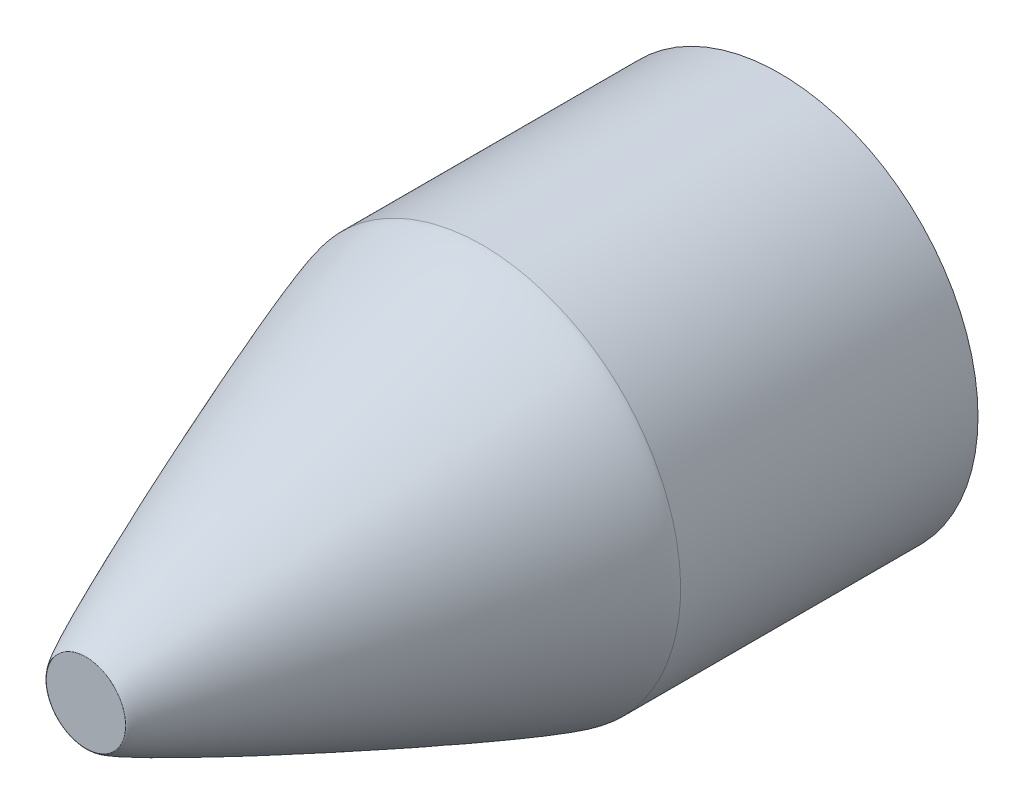
ISO-10303-21;
HEADER;
FILE_DESCRIPTION(('STEP AP214'),'2;1');
FILE_NAME('part.step','',(''),(''),'','','');
FILE_SCHEMA(('AUTOMOTIVE_DESIGN { 1 0 10303 214 1 1 1 1 }'));
ENDSEC;
DATA;
#1=APPLICATION_CONTEXT('core data for automotive mechanical design processes');
#2=APPLICATION_PROTOCOL_DEFINITION('international standard','automotive_design',2000,#1);
#3=PRODUCT_CONTEXT('',#1,'mechanical');
#4=PRODUCT('Part','Part','',(#3));
#5=PRODUCT_RELATED_PRODUCT_CATEGORY('part','',(#4));
#6=PRODUCT_DEFINITION_FORMATION('','',#4);
#7=PRODUCT_DEFINITION_CONTEXT('part definition',#1,'design');
#8=PRODUCT_DEFINITION('design','',#6,#7);
#9=PRODUCT_DEFINITION_SHAPE('','',#8);
#10=(LENGTH_UNIT() NAMED_UNIT(*) SI_UNIT(.MILLI.,.METRE.));
#11=(NAMED_UNIT(*) PLANE_ANGLE_UNIT() SI_UNIT($,.RADIAN.));
#12=(NAMED_UNIT(*) SI_UNIT($,.STERADIAN.) SOLID_ANGLE_UNIT());
#13=UNCERTAINTY_MEASURE_WITH_UNIT(LENGTH_MEASURE(1.E-05),#10,'distance_accuracy_value','');
#14=(GEOMETRIC_REPRESENTATION_CONTEXT(3) GLOBAL_UNCERTAINTY_ASSIGNED_CONTEXT((#13)) GLOBAL_UNIT_ASSIGNED_CONTEXT((#10,
#11,#12)) REPRESENTATION_CONTEXT('',''));
#15=CARTESIAN_POINT('',(0.,0.,0.));
#16=DIRECTION('',(0.,0.,1.));
#17=DIRECTION('',(1.,0.,0.));
#18=AXIS2_PLACEMENT_3D('',#15,#16,#17);
#19=CARTESIAN_POINT('',(-2.,0.,35.));
#20=CARTESIAN_POINT('',(-2.,-0.523598753781683,35.));
#21=CARTESIAN_POINT('',(-1.78445379179298,-1.04397333295321,35.));
#22=CARTESIAN_POINT('',(-1.0439733329532,-1.78445379179299,35.));
#23=CARTESIAN_POINT('',(-0.523598753781449,-2.,35.));
#24=CARTESIAN_POINT('',(0.523598753781452,-2.,35.));
#25=CARTESIAN_POINT('',(1.04397333295304,-1.78445379179315,35.));
#26=CARTESIAN_POINT('',(1.78445379179315,-1.04397333295304,35.));
#27=CARTESIAN_POINT('',(2.,-0.523598753781667,35.));
#28=CARTESIAN_POINT('',(2.,0.523598753781667,35.));
#29=CARTESIAN_POINT('',(1.78445379179298,1.04397333295321,35.));
#30=CARTESIAN_POINT('',(1.04397333295321,1.78445379179298,35.));
#31=CARTESIAN_POINT('',(0.523598753781684,2.,35.));
#32=CARTESIAN_POINT('',(-0.523598753781683,2.,35.));
#33=CARTESIAN_POINT('',(-1.04397333295326,1.78445379179293,35.));
#34=CARTESIAN_POINT('',(-1.78445379179293,1.04397333295326,35.));
#35=CARTESIAN_POINT('',(-2.,0.523598753781684,35.));
#36=CARTESIAN_POINT('',(-2.,0.,35.));
#37=CARTESIAN_POINT('',(-10.,0.,35.));
#38=CARTESIAN_POINT('',(-10.,-2.61799376890842,35.));
#39=CARTESIAN_POINT('',(-8.92226895896498,-5.21986666476575,35.));
#40=CARTESIAN_POINT('',(-5.21986666476597,-8.92226895896522,35.));
#41=CARTESIAN_POINT('',(-2.61799376890725,-10.,35.));
#42=CARTESIAN_POINT('',(2.61799376890726,-10.,35.));
#43=CARTESIAN_POINT('',(5.21986666476493,-8.92226895896535,35.));
#44=CARTESIAN_POINT('',(8.92226895896604,-5.2198666647656,35.));
#45=CARTESIAN_POINT('',(10.0000000000005,-2.61799376890833,35.0000000000036));
#46=CARTESIAN_POINT('',(9.99999999999955,2.61799376890833,34.9999999999964));
#47=CARTESIAN_POINT('',(8.9222689589649,5.21986666476606,35.));
#48=CARTESIAN_POINT('',(5.21986666476606,8.9222689589649,35.));
#49=CARTESIAN_POINT('',(2.61799376890842,10.,35.));
#50=CARTESIAN_POINT('',(-2.61799376890842,10.,35.));
#51=CARTESIAN_POINT('',(-5.2198666647662,8.92226895896453,35.));
#52=CARTESIAN_POINT('',(-8.92226895896476,5.21986666476642,35.));
#53=CARTESIAN_POINT('',(-10.,2.61799376890842,35.));
#54=CARTESIAN_POINT('',(-10.,0.,35.));
#55=CARTESIAN_POINT('',(-10.,0.,15.));
#56=CARTESIAN_POINT('',(-10.,-2.61799376890842,15.));
#57=CARTESIAN_POINT('',(-8.92226895896498,-5.21986666476598,15.));
#58=CARTESIAN_POINT('',(-5.21986666476597,-8.92226895896498,15.));
#59=CARTESIAN_POINT('',(-2.61799376890725,-10.,15.));
#60=CARTESIAN_POINT('',(2.61799376890726,-10.,15.));
#61=CARTESIAN_POINT('',(5.21986666476527,-8.92226895896569,15.));
#62=CARTESIAN_POINT('',(8.92226895896569,-5.21986666476526,15.));
#63=CARTESIAN_POINT('',(10.,-2.61799376890833,15.));
#64=CARTESIAN_POINT('',(10.,2.61799376890833,15.));
#65=CARTESIAN_POINT('',(8.9222689589649,5.21986666476606,15.));
#66=CARTESIAN_POINT('',(5.21986666476606,8.92226895896489,15.));
#67=CARTESIAN_POINT('',(2.61799376890842,10.,15.));
#68=CARTESIAN_POINT('',(-2.61799376890842,10.,15.));
#69=CARTESIAN_POINT('',(-5.21986666476632,8.92226895896464,15.));
#70=CARTESIAN_POINT('',(-8.92226895896465,5.21986666476631,15.));
#71=CARTESIAN_POINT('',(-10.,2.61799376890842,15.));
#72=CARTESIAN_POINT('',(-10.,0.,15.));
#73=(BOUNDED_SURFACE() B_SPLINE_SURFACE(2,3,((#19,#20,#21,#22,#23,#24,#25,#26,#27,#28,#29,#30,
#31,#32,#33,#34,#35,#36),(#37,#38,#39,#40,#41,#42,#43,#44,#45,#46,#47,#48,#49,#50,#51,#52,#53,
#54),(#55,#56,#57,#58,#59,#60,#61,#62,#63,#64,#65,#66,#67,#68,#69,#70,#71,#72)),.UNSPECIFIED.,
.F.,.T.,.F.) B_SPLINE_SURFACE_WITH_KNOTS((3,3),(4,2,2,2,2,2,2,2,4),(0.,1.),(-3.14159265358979,
-2.35619449019234,-1.5707963267949,-0.785398163397448,0.,0.785398163397448,1.5707963267949,
2.35619449019234,3.14159265358979),
.UNSPECIFIED.) GEOMETRIC_REPRESENTATION_ITEM() RATIONAL_B_SPLINE_SURFACE(((1.,1.,1.,1.,1.,1.,1.,
1.,1.,1.,1.,1.,1.,1.,1.,1.,1.,1.),(0.0526315789473684,0.0526315789473684,0.0526315789473684,
0.0526315789473684,0.0526315789473684,0.0526315789473684,0.0526315789473684,0.0526315789473684,
0.0526315789473684,0.0526315789473684,0.0526315789473684,0.0526315789473684,0.0526315789473684,
0.0526315789473684,0.0526315789473684,0.0526315789473684,0.0526315789473684,0.0526315789473684),
(1.,1.,1.,1.,1.,1.,1.,1.,1.,1.,1.,1.,1.,1.,1.,1.,1.,1.))) REPRESENTATION_ITEM('') SURFACE());
#74=CARTESIAN_POINT('',(-2.,0.,35.));
#75=CARTESIAN_POINT('',(-2.,0.523598753781684,35.));
#76=CARTESIAN_POINT('',(-1.78445379179293,1.04397333295326,35.));
#77=CARTESIAN_POINT('',(-1.04397333295326,1.78445379179293,35.));
#78=CARTESIAN_POINT('',(-0.523598753781683,2.,35.));
#79=CARTESIAN_POINT('',(0.523598753781684,2.,35.));
#80=CARTESIAN_POINT('',(1.04397333295321,1.78445379179298,35.));
#81=CARTESIAN_POINT('',(1.78445379179298,1.04397333295321,35.));
#82=CARTESIAN_POINT('',(2.,0.523598753781667,35.));
#83=CARTESIAN_POINT('',(2.,-0.523598753781667,35.));
#84=CARTESIAN_POINT('',(1.78445379179315,-1.04397333295304,35.));
#85=CARTESIAN_POINT('',(1.04397333295304,-1.78445379179315,35.));
#86=CARTESIAN_POINT('',(0.523598753781452,-2.,35.));
#87=CARTESIAN_POINT('',(-0.523598753781449,-2.,35.));
#88=CARTESIAN_POINT('',(-1.0439733329532,-1.78445379179299,35.));
#89=CARTESIAN_POINT('',(-1.78445379179298,-1.04397333295321,35.));
#90=CARTESIAN_POINT('',(-2.,-0.523598753781683,35.));
#91=CARTESIAN_POINT('',(-2.,0.,35.));
#92=(BOUNDED_CURVE() B_SPLINE_CURVE(3,(#74,#75,#76,#77,#78,#79,#80,#81,#82,#83,#84,#85,#86,#87,
#88,#89,#90,#91),.UNSPECIFIED.,.T.,.F.) B_SPLINE_CURVE_WITH_KNOTS((4,2,2,2,2,2,2,2,4),
(-3.14159265358979,-2.35619449019234,-1.5707963267949,-0.785398163397448,0.,0.785398163397448,
1.5707963267949,2.35619449019234,3.14159265358979),
.UNSPECIFIED.) CURVE() GEOMETRIC_REPRESENTATION_ITEM() RATIONAL_B_SPLINE_CURVE((1.,1.,1.,1.,1.,
1.,1.,1.,1.,1.,1.,1.,1.,1.,1.,1.,1.,1.)) REPRESENTATION_ITEM(''));
#93=CARTESIAN_POINT('',(-2.,0.,35.));
#94=VERTEX_POINT('',#93);
#95=EDGE_CURVE('E470',#94,#94,#92,.F.);
#96=CARTESIAN_POINT('',(-10.,0.,15.));
#97=CARTESIAN_POINT('',(-10.,-2.61799376890842,15.));
#98=CARTESIAN_POINT('',(-8.92226895896498,-5.21986666476598,15.));
#99=CARTESIAN_POINT('',(-5.21986666476597,-8.92226895896498,15.));
#100=CARTESIAN_POINT('',(-2.61799376890725,-10.,15.));
#101=CARTESIAN_POINT('',(2.61799376890726,-10.,15.));
#102=CARTESIAN_POINT('',(5.21986666476527,-8.92226895896569,15.));
#103=CARTESIAN_POINT('',(8.92226895896569,-5.21986666476526,15.));
#104=CARTESIAN_POINT('',(10.,-2.61799376890833,15.));
#105=CARTESIAN_POINT('',(10.,2.61799376890833,15.));
#106=CARTESIAN_POINT('',(8.9222689589649,5.21986666476606,15.));
#107=CARTESIAN_POINT('',(5.21986666476606,8.92226895896489,15.));
#108=CARTESIAN_POINT('',(2.61799376890842,10.,15.));
#109=CARTESIAN_POINT('',(-2.61799376890842,10.,15.));
#110=CARTESIAN_POINT('',(-5.21986666476632,8.92226895896464,15.));
#111=CARTESIAN_POINT('',(-8.92226895896465,5.21986666476631,15.));
#112=CARTESIAN_POINT('',(-10.,2.61799376890842,15.));
#113=CARTESIAN_POINT('',(-10.,0.,15.));
#114=(BOUNDED_CURVE() B_SPLINE_CURVE(3,(#96,#97,#98,#99,#100,#101,#102,#103,#104,#105,#106,#107,
#108,#109,#110,#111,#112,#113),.UNSPECIFIED.,.T.,.F.) B_SPLINE_CURVE_WITH_KNOTS((4,2,2,2,2,2,2,
2,4),(-3.14159265358979,-2.35619449019234,-1.5707963267949,-0.785398163397448,0.,
0.785398163397448,1.5707963267949,2.35619449019234,3.14159265358979),
.UNSPECIFIED.) CURVE() GEOMETRIC_REPRESENTATION_ITEM() RATIONAL_B_SPLINE_CURVE((1.,1.,1.,1.,1.,
1.,1.,1.,1.,1.,1.,1.,1.,1.,1.,1.,1.,1.)) REPRESENTATION_ITEM(''));
#115=CARTESIAN_POINT('',(-10.,0.,15.));
#116=VERTEX_POINT('',#115);
#117=EDGE_CURVE('E474',#116,#116,#114,.F.);
#118=ORIENTED_EDGE('',*,*,#95,.F.);
#119=EDGE_LOOP('',(#118));
#120=FACE_BOUND('',#119,.T.);
#121=ORIENTED_EDGE('',*,*,#117,.F.);
#122=EDGE_LOOP('',(#121));
#123=FACE_BOUND('',#122,.T.);
#124=ADVANCED_FACE('F38',(#120,#123),#73,.T.);
#125=CARTESIAN_POINT('',(0.,0.,35.));
#126=DIRECTION('',(0.,0.,-1.));
#127=DIRECTION('',(-1.,0.,0.));
#128=AXIS2_PLACEMENT_3D('',#125,#126,#127);
#129=CYLINDRICAL_SURFACE('',#128,10.);
#130=ORIENTED_EDGE('',*,*,#117,.T.);
#131=EDGE_LOOP('',(#130));
#132=FACE_BOUND('',#131,.T.);
#133=CARTESIAN_POINT('',(0.,0.,0.));
#134=DIRECTION('',(0.,0.,1.));
#135=DIRECTION('',(1.,0.,0.));
#136=AXIS2_PLACEMENT_3D('',#133,#134,#135);
#137=CIRCLE('',#136,10.);
#138=CARTESIAN_POINT('',(10.,0.,0.));
#139=VERTEX_POINT('',#138);
#140=EDGE_CURVE('E342',#139,#139,#137,.T.);
#141=ORIENTED_EDGE('',*,*,#140,.T.);
#142=EDGE_LOOP('',(#141));
#143=FACE_BOUND('',#142,.T.);
#144=ADVANCED_FACE('F460',(#132,#143),#129,.T.);
#145=CARTESIAN_POINT('',(0.,0.,35.));
#146=DIRECTION('',(0.,0.,1.));
#147=DIRECTION('',(1.,0.,0.));
#148=AXIS2_PLACEMENT_3D('',#145,#146,#147);
#149=PLANE('',#148);
#150=ORIENTED_EDGE('',*,*,#95,.T.);
#151=EDGE_LOOP('',(#150));
#152=FACE_BOUND('',#151,.T.);
#153=ADVANCED_FACE('F465',(#152),#149,.T.);
#154=CARTESIAN_POINT('',(0.,0.,0.));
#155=DIRECTION('',(0.,0.,1.));
#156=DIRECTION('',(1.,0.,0.));
#157=AXIS2_PLACEMENT_3D('',#154,#155,#156);
#158=PLANE('',#157);
#159=DIRECTION('',(1.,0.,0.));
#160=VECTOR('',#159,1.);
#161=CARTESIAN_POINT('',(6.5,5.5,0.));
#162=LINE('',#161,#160);
#163=CARTESIAN_POINT('',(-1.49999999999999,5.5,0.));
#164=VERTEX_POINT('',#163);
#165=CARTESIAN_POINT('',(1.5,5.5,0.));
#166=VERTEX_POINT('',#165);
#167=EDGE_CURVE('E350',#164,#166,#162,.T.);
#168=ORIENTED_EDGE('',*,*,#167,.F.);
#169=CARTESIAN_POINT('',(-6.5,0.5,0.));
#170=CARTESIAN_POINT('',(-6.5,5.5,0.));
#171=CARTESIAN_POINT('',(-1.5,5.5,0.));
#172=(BOUNDED_CURVE() B_SPLINE_CURVE(2,(#169,#170,#171),.UNSPECIFIED.,.F.,
.F.) B_SPLINE_CURVE_WITH_KNOTS((3,3),(0.,1.),
.UNSPECIFIED.) CURVE() GEOMETRIC_REPRESENTATION_ITEM() RATIONAL_B_SPLINE_CURVE((1.,0.25,1.)) REPRESENTATION_ITEM(''));
#173=CARTESIAN_POINT('',(-6.5,0.5,0.));
#174=VERTEX_POINT('',#173);
#175=EDGE_CURVE('E12',#164,#174,#172,.F.);
#176=ORIENTED_EDGE('',*,*,#175,.T.);
#177=DIRECTION('',(0.,1.,0.));
#178=VECTOR('',#177,1.);
#179=CARTESIAN_POINT('',(-6.5,-5.5,0.));
#180=LINE('',#179,#178);
#181=CARTESIAN_POINT('',(-6.5,-0.499999999999999,0.));
#182=VERTEX_POINT('',#181);
#183=EDGE_CURVE('E357',#182,#174,#180,.T.);
#184=ORIENTED_EDGE('',*,*,#183,.F.);
#185=CARTESIAN_POINT('',(-1.5,-5.5,0.));
#186=CARTESIAN_POINT('',(-6.5,-5.5,0.));
#187=CARTESIAN_POINT('',(-6.5,-0.499999999999999,0.));
#188=(BOUNDED_CURVE() B_SPLINE_CURVE(2,(#185,#186,#187),.UNSPECIFIED.,.F.,
.F.) B_SPLINE_CURVE_WITH_KNOTS((3,3),(0.,1.),
.UNSPECIFIED.) CURVE() GEOMETRIC_REPRESENTATION_ITEM() RATIONAL_B_SPLINE_CURVE((1.,0.25,1.)) REPRESENTATION_ITEM(''));
#189=CARTESIAN_POINT('',(-1.49999999999999,-5.5,0.));
#190=VERTEX_POINT('',#189);
#191=EDGE_CURVE('E52',#182,#190,#188,.F.);
#192=ORIENTED_EDGE('',*,*,#191,.T.);
#193=DIRECTION('',(-1.,0.,0.));
#194=VECTOR('',#193,1.);
#195=CARTESIAN_POINT('',(6.5,-5.5,0.));
#196=LINE('',#195,#194);
#197=CARTESIAN_POINT('',(1.5,-5.5,0.));
#198=VERTEX_POINT('',#197);
#199=EDGE_CURVE('E336',#198,#190,#196,.T.);
#200=ORIENTED_EDGE('',*,*,#199,.F.);
#201=CARTESIAN_POINT('',(6.5,-0.499999999999999,0.));
#202=CARTESIAN_POINT('',(6.5,-5.5,0.));
#203=CARTESIAN_POINT('',(1.5,-5.5,0.));
#204=(BOUNDED_CURVE() B_SPLINE_CURVE(2,(#201,#202,#203),.UNSPECIFIED.,.F.,
.F.) B_SPLINE_CURVE_WITH_KNOTS((3,3),(0.,1.),
.UNSPECIFIED.) CURVE() GEOMETRIC_REPRESENTATION_ITEM() RATIONAL_B_SPLINE_CURVE((1.,0.25,1.)) REPRESENTATION_ITEM(''));
#205=CARTESIAN_POINT('',(6.5,-0.499999999999999,0.));
#206=VERTEX_POINT('',#205);
#207=EDGE_CURVE('E205',#198,#206,#204,.F.);
#208=ORIENTED_EDGE('',*,*,#207,.T.);
#209=DIRECTION('',(0.,-1.,0.));
#210=VECTOR('',#209,1.);
#211=CARTESIAN_POINT('',(6.5,-5.5,0.));
#212=LINE('',#211,#210);
#213=CARTESIAN_POINT('',(6.5,0.5,0.));
#214=VERTEX_POINT('',#213);
#215=EDGE_CURVE('E356',#214,#206,#212,.T.);
#216=ORIENTED_EDGE('',*,*,#215,.F.);
#217=CARTESIAN_POINT('',(1.5,5.5,0.));
#218=CARTESIAN_POINT('',(6.5,5.5,0.));
#219=CARTESIAN_POINT('',(6.5,0.5,0.));
#220=(BOUNDED_CURVE() B_SPLINE_CURVE(2,(#217,#218,#219),.UNSPECIFIED.,.F.,
.F.) B_SPLINE_CURVE_WITH_KNOTS((3,3),(0.,1.),
.UNSPECIFIED.) CURVE() GEOMETRIC_REPRESENTATION_ITEM() RATIONAL_B_SPLINE_CURVE((1.,0.25,1.)) REPRESENTATION_ITEM(''));
#221=EDGE_CURVE('E141',#214,#166,#220,.F.);
#222=ORIENTED_EDGE('',*,*,#221,.T.);
#223=EDGE_LOOP('',(#168,#176,#184,#192,#200,#208,#216,#222));
#224=FACE_BOUND('',#223,.T.);
#225=ORIENTED_EDGE('',*,*,#140,.F.);
#226=EDGE_LOOP('',(#225));
#227=FACE_BOUND('',#226,.T.);
#228=ADVANCED_FACE('F353',(#224,#227),#158,.F.);
#229=CARTESIAN_POINT('',(-6.5,-5.5,20.));
#230=DIRECTION('',(-1.,0.,0.));
#231=DIRECTION('',(0.,0.,1.));
#232=AXIS2_PLACEMENT_3D('',#229,#230,#231);
#233=PLANE('',#232);
#234=DIRECTION('',(0.,1.,0.));
#235=VECTOR('',#234,1.);
#236=CARTESIAN_POINT('',(-6.5,-5.5,20.));
#237=LINE('',#236,#235);
#238=CARTESIAN_POINT('',(-6.5,-0.499999999999999,20.));
#239=VERTEX_POINT('',#238);
#240=CARTESIAN_POINT('',(-6.5,0.5,20.));
#241=VERTEX_POINT('',#240);
#242=EDGE_CURVE('E411',#239,#241,#237,.T.);
#243=ORIENTED_EDGE('',*,*,#242,.F.);
#244=CARTESIAN_POINT('',(-6.5,-0.499999999999999,-1.));
#245=CARTESIAN_POINT('',(-6.5,-0.499999999999999,6.33333333333333));
#246=CARTESIAN_POINT('',(-6.5,-0.499999999999999,13.6666666666667));
#247=CARTESIAN_POINT('',(-6.5,-0.499999999999999,21.));
#248=(BOUNDED_CURVE() B_SPLINE_CURVE(3,(#244,#245,#246,#247),.UNSPECIFIED.,.F.,
.F.) B_SPLINE_CURVE_WITH_KNOTS((4,4),(-0.021,0.001),
.UNSPECIFIED.) CURVE() GEOMETRIC_REPRESENTATION_ITEM() RATIONAL_B_SPLINE_CURVE((1.,1.,1.,1.)) REPRESENTATION_ITEM(''));
#249=EDGE_CURVE('E327',#239,#182,#248,.F.);
#250=ORIENTED_EDGE('',*,*,#249,.T.);
#251=ORIENTED_EDGE('',*,*,#183,.T.);
#252=CARTESIAN_POINT('',(-6.5,0.5,21.));
#253=CARTESIAN_POINT('',(-6.5,0.5,13.6666666666667));
#254=CARTESIAN_POINT('',(-6.5,0.5,6.33333333333333));
#255=CARTESIAN_POINT('',(-6.5,0.5,-1.));
#256=(BOUNDED_CURVE() B_SPLINE_CURVE(3,(#252,#253,#254,#255),.UNSPECIFIED.,.F.,
.F.) B_SPLINE_CURVE_WITH_KNOTS((4,4),(-0.021,0.001),
.UNSPECIFIED.) CURVE() GEOMETRIC_REPRESENTATION_ITEM() RATIONAL_B_SPLINE_CURVE((1.,1.,1.,1.)) REPRESENTATION_ITEM(''));
#257=EDGE_CURVE('E322',#174,#241,#256,.F.);
#258=ORIENTED_EDGE('',*,*,#257,.T.);
#259=EDGE_LOOP('',(#243,#250,#251,#258));
#260=FACE_BOUND('',#259,.T.);
#261=ADVANCED_FACE('F396',(#260),#233,.F.);
#262=CARTESIAN_POINT('',(6.5,-5.5,20.));
#263=DIRECTION('',(0.,-1.,0.));
#264=DIRECTION('',(0.,0.,-1.));
#265=AXIS2_PLACEMENT_3D('',#262,#263,#264);
#266=PLANE('',#265);
#267=DIRECTION('',(-1.,0.,0.));
#268=VECTOR('',#267,1.);
#269=CARTESIAN_POINT('',(6.5,-5.5,20.));
#270=LINE('',#269,#268);
#271=CARTESIAN_POINT('',(1.5,-5.5,20.));
#272=VERTEX_POINT('',#271);
#273=CARTESIAN_POINT('',(-1.49999999999999,-5.5,20.));
#274=VERTEX_POINT('',#273);
#275=EDGE_CURVE('E137',#272,#274,#270,.T.);
#276=ORIENTED_EDGE('',*,*,#275,.F.);
#277=CARTESIAN_POINT('',(1.5,-5.5,-1.));
#278=CARTESIAN_POINT('',(1.5,-5.5,6.33333333333333));
#279=CARTESIAN_POINT('',(1.5,-5.5,13.6666666666667));
#280=CARTESIAN_POINT('',(1.5,-5.5,21.));
#281=(BOUNDED_CURVE() B_SPLINE_CURVE(3,(#277,#278,#279,#280),.UNSPECIFIED.,.F.,
.F.) B_SPLINE_CURVE_WITH_KNOTS((4,4),(-0.021,0.001),
.UNSPECIFIED.) CURVE() GEOMETRIC_REPRESENTATION_ITEM() RATIONAL_B_SPLINE_CURVE((1.,1.,1.,1.)) REPRESENTATION_ITEM(''));
#282=EDGE_CURVE('E216',#272,#198,#281,.F.);
#283=ORIENTED_EDGE('',*,*,#282,.T.);
#284=ORIENTED_EDGE('',*,*,#199,.T.);
#285=CARTESIAN_POINT('',(-1.5,-5.5,21.));
#286=CARTESIAN_POINT('',(-1.5,-5.5,13.6666666666667));
#287=CARTESIAN_POINT('',(-1.5,-5.5,6.33333333333333));
#288=CARTESIAN_POINT('',(-1.5,-5.5,-1.));
#289=(BOUNDED_CURVE() B_SPLINE_CURVE(3,(#285,#286,#287,#288),.UNSPECIFIED.,.F.,
.F.) B_SPLINE_CURVE_WITH_KNOTS((4,4),(-0.021,0.001),
.UNSPECIFIED.) CURVE() GEOMETRIC_REPRESENTATION_ITEM() RATIONAL_B_SPLINE_CURVE((1.,1.,1.,1.)) REPRESENTATION_ITEM(''));
#290=EDGE_CURVE('E123',#190,#274,#289,.F.);
#291=ORIENTED_EDGE('',*,*,#290,.T.);
#292=EDGE_LOOP('',(#276,#283,#284,#291));
#293=FACE_BOUND('',#292,.T.);
#294=ADVANCED_FACE('F335',(#293),#266,.F.);
#295=CARTESIAN_POINT('',(6.5,-5.5,20.));
#296=DIRECTION('',(1.,0.,0.));
#297=DIRECTION('',(0.,0.,-1.));
#298=AXIS2_PLACEMENT_3D('',#295,#296,#297);
#299=PLANE('',#298);
#300=DIRECTION('',(0.,-1.,0.));
#301=VECTOR('',#300,1.);
#302=CARTESIAN_POINT('',(6.5,-5.5,20.));
#303=LINE('',#302,#301);
#304=CARTESIAN_POINT('',(6.5,0.5,20.));
#305=VERTEX_POINT('',#304);
#306=CARTESIAN_POINT('',(6.5,-0.499999999999999,20.));
#307=VERTEX_POINT('',#306);
#308=EDGE_CURVE('E115',#305,#307,#303,.T.);
#309=ORIENTED_EDGE('',*,*,#308,.F.);
#310=CARTESIAN_POINT('',(6.5,0.5,-1.));
#311=CARTESIAN_POINT('',(6.5,0.5,6.33333333333333));
#312=CARTESIAN_POINT('',(6.5,0.5,13.6666666666667));
#313=CARTESIAN_POINT('',(6.5,0.5,21.));
#314=(BOUNDED_CURVE() B_SPLINE_CURVE(3,(#310,#311,#312,#313),.UNSPECIFIED.,.F.,
.F.) B_SPLINE_CURVE_WITH_KNOTS((4,4),(-0.021,0.001),
.UNSPECIFIED.) CURVE() GEOMETRIC_REPRESENTATION_ITEM() RATIONAL_B_SPLINE_CURVE((1.,1.,1.,1.)) REPRESENTATION_ITEM(''));
#315=EDGE_CURVE('E131',#305,#214,#314,.F.);
#316=ORIENTED_EDGE('',*,*,#315,.T.);
#317=ORIENTED_EDGE('',*,*,#215,.T.);
#318=CARTESIAN_POINT('',(6.5,-0.499999999999999,21.));
#319=CARTESIAN_POINT('',(6.5,-0.499999999999999,13.6666666666667));
#320=CARTESIAN_POINT('',(6.5,-0.499999999999999,6.33333333333333));
#321=CARTESIAN_POINT('',(6.5,-0.499999999999999,-1.));
#322=(BOUNDED_CURVE() B_SPLINE_CURVE(3,(#318,#319,#320,#321),.UNSPECIFIED.,.F.,
.F.) B_SPLINE_CURVE_WITH_KNOTS((4,4),(-0.021,0.001),
.UNSPECIFIED.) CURVE() GEOMETRIC_REPRESENTATION_ITEM() RATIONAL_B_SPLINE_CURVE((1.,1.,1.,1.)) REPRESENTATION_ITEM(''));
#323=EDGE_CURVE('E135',#206,#307,#322,.F.);
#324=ORIENTED_EDGE('',*,*,#323,.T.);
#325=EDGE_LOOP('',(#309,#316,#317,#324));
#326=FACE_BOUND('',#325,.T.);
#327=ADVANCED_FACE('F129',(#326),#299,.F.);
#328=CARTESIAN_POINT('',(6.5,5.5,20.));
#329=DIRECTION('',(0.,1.,0.));
#330=DIRECTION('',(0.,0.,1.));
#331=AXIS2_PLACEMENT_3D('',#328,#329,#330);
#332=PLANE('',#331);
#333=ORIENTED_EDGE('',*,*,#167,.T.);
#334=CARTESIAN_POINT('',(1.5,5.5,21.));
#335=CARTESIAN_POINT('',(1.5,5.5,13.6666666666667));
#336=CARTESIAN_POINT('',(1.5,5.5,6.33333333333333));
#337=CARTESIAN_POINT('',(1.5,5.5,-1.));
#338=(BOUNDED_CURVE() B_SPLINE_CURVE(3,(#334,#335,#336,#337),.UNSPECIFIED.,.F.,
.F.) B_SPLINE_CURVE_WITH_KNOTS((4,4),(-0.021,0.001),
.UNSPECIFIED.) CURVE() GEOMETRIC_REPRESENTATION_ITEM() RATIONAL_B_SPLINE_CURVE((1.,1.,1.,1.)) REPRESENTATION_ITEM(''));
#339=CARTESIAN_POINT('',(1.5,5.5,20.));
#340=VERTEX_POINT('',#339);
#341=EDGE_CURVE('E193',#166,#340,#338,.F.);
#342=ORIENTED_EDGE('',*,*,#341,.T.);
#343=DIRECTION('',(1.,0.,0.));
#344=VECTOR('',#343,1.);
#345=CARTESIAN_POINT('',(6.5,5.5,20.));
#346=LINE('',#345,#344);
#347=CARTESIAN_POINT('',(-1.49999999999999,5.5,20.));
#348=VERTEX_POINT('',#347);
#349=EDGE_CURVE('E118',#348,#340,#346,.T.);
#350=ORIENTED_EDGE('',*,*,#349,.F.);
#351=CARTESIAN_POINT('',(-1.5,5.5,-1.));
#352=CARTESIAN_POINT('',(-1.5,5.5,6.33333333333333));
#353=CARTESIAN_POINT('',(-1.5,5.5,13.6666666666667));
#354=CARTESIAN_POINT('',(-1.5,5.5,21.));
#355=(BOUNDED_CURVE() B_SPLINE_CURVE(3,(#351,#352,#353,#354),.UNSPECIFIED.,.F.,
.F.) B_SPLINE_CURVE_WITH_KNOTS((4,4),(-0.021,0.001),
.UNSPECIFIED.) CURVE() GEOMETRIC_REPRESENTATION_ITEM() RATIONAL_B_SPLINE_CURVE((1.,1.,1.,1.)) REPRESENTATION_ITEM(''));
#356=EDGE_CURVE('E143',#348,#164,#355,.F.);
#357=ORIENTED_EDGE('',*,*,#356,.T.);
#358=EDGE_LOOP('',(#333,#342,#350,#357));
#359=FACE_BOUND('',#358,.T.);
#360=ADVANCED_FACE('F349',(#359),#332,.F.);
#361=CARTESIAN_POINT('',(0.,0.,20.));
#362=DIRECTION('',(0.,0.,1.));
#363=DIRECTION('',(1.,0.,0.));
#364=AXIS2_PLACEMENT_3D('',#361,#362,#363);
#365=PLANE('',#364);
#366=ORIENTED_EDGE('',*,*,#349,.T.);
#367=CARTESIAN_POINT('',(6.5,0.5,20.));
#368=CARTESIAN_POINT('',(6.5,5.5,20.));
#369=CARTESIAN_POINT('',(1.5,5.5,20.));
#370=(BOUNDED_CURVE() B_SPLINE_CURVE(2,(#367,#368,#369),.UNSPECIFIED.,.F.,
.F.) B_SPLINE_CURVE_WITH_KNOTS((3,3),(0.,1.),
.UNSPECIFIED.) CURVE() GEOMETRIC_REPRESENTATION_ITEM() RATIONAL_B_SPLINE_CURVE((1.,0.25,1.)) REPRESENTATION_ITEM(''));
#371=EDGE_CURVE('E111',#340,#305,#370,.F.);
#372=ORIENTED_EDGE('',*,*,#371,.T.);
#373=ORIENTED_EDGE('',*,*,#308,.T.);
#374=CARTESIAN_POINT('',(1.5,-5.5,20.));
#375=CARTESIAN_POINT('',(6.5,-5.5,20.));
#376=CARTESIAN_POINT('',(6.5,-0.499999999999999,20.));
#377=(BOUNDED_CURVE() B_SPLINE_CURVE(2,(#374,#375,#376),.UNSPECIFIED.,.F.,
.F.) B_SPLINE_CURVE_WITH_KNOTS((3,3),(0.,1.),
.UNSPECIFIED.) CURVE() GEOMETRIC_REPRESENTATION_ITEM() RATIONAL_B_SPLINE_CURVE((1.,0.25,1.)) REPRESENTATION_ITEM(''));
#378=EDGE_CURVE('E124',#307,#272,#377,.F.);
#379=ORIENTED_EDGE('',*,*,#378,.T.);
#380=ORIENTED_EDGE('',*,*,#275,.T.);
#381=CARTESIAN_POINT('',(-6.5,-0.499999999999999,20.));
#382=CARTESIAN_POINT('',(-6.5,-5.5,20.));
#383=CARTESIAN_POINT('',(-1.5,-5.5,20.));
#384=(BOUNDED_CURVE() B_SPLINE_CURVE(2,(#381,#382,#383),.UNSPECIFIED.,.F.,
.F.) B_SPLINE_CURVE_WITH_KNOTS((3,3),(0.,1.),
.UNSPECIFIED.) CURVE() GEOMETRIC_REPRESENTATION_ITEM() RATIONAL_B_SPLINE_CURVE((1.,0.25,1.)) REPRESENTATION_ITEM(''));
#385=EDGE_CURVE('E339',#274,#239,#384,.F.);
#386=ORIENTED_EDGE('',*,*,#385,.T.);
#387=ORIENTED_EDGE('',*,*,#242,.T.);
#388=CARTESIAN_POINT('',(-1.5,5.5,20.));
#389=CARTESIAN_POINT('',(-6.5,5.5,20.));
#390=CARTESIAN_POINT('',(-6.5,0.5,20.));
#391=(BOUNDED_CURVE() B_SPLINE_CURVE(2,(#388,#389,#390),.UNSPECIFIED.,.F.,
.F.) B_SPLINE_CURVE_WITH_KNOTS((3,3),(0.,1.),
.UNSPECIFIED.) CURVE() GEOMETRIC_REPRESENTATION_ITEM() RATIONAL_B_SPLINE_CURVE((1.,0.25,1.)) REPRESENTATION_ITEM(''));
#392=EDGE_CURVE('E314',#241,#348,#391,.F.);
#393=ORIENTED_EDGE('',*,*,#392,.T.);
#394=EDGE_LOOP('',(#366,#372,#373,#379,#380,#386,#387,#393));
#395=FACE_BOUND('',#394,.T.);
#396=ADVANCED_FACE('F114',(#395),#365,.F.);
#397=CARTESIAN_POINT('',(1.5,5.5,-1.));
#398=CARTESIAN_POINT('',(1.5,5.5,6.33333333333333));
#399=CARTESIAN_POINT('',(1.5,5.5,13.6666666666667));
#400=CARTESIAN_POINT('',(1.5,5.5,21.));
#401=CARTESIAN_POINT('',(6.5,5.5,-1.));
#402=CARTESIAN_POINT('',(6.5,5.5,6.33333333333333));
#403=CARTESIAN_POINT('',(6.5,5.5,13.6666666666667));
#404=CARTESIAN_POINT('',(6.5,5.5,21.));
#405=CARTESIAN_POINT('',(6.5,0.5,-1.));
#406=CARTESIAN_POINT('',(6.5,0.5,6.33333333333333));
#407=CARTESIAN_POINT('',(6.5,0.5,13.6666666666667));
#408=CARTESIAN_POINT('',(6.5,0.5,21.));
#409=(BOUNDED_SURFACE() B_SPLINE_SURFACE(2,3,((#397,#398,#399,#400),(#401,#402,#403,#404),(#405,
#406,#407,#408)),.UNSPECIFIED.,.F.,.F.,.F.) B_SPLINE_SURFACE_WITH_KNOTS((3,3),(4,4),(0.,1.),
(-0.021,0.001),.UNSPECIFIED.) GEOMETRIC_REPRESENTATION_ITEM() RATIONAL_B_SPLINE_SURFACE(((1.,1.,
1.,1.),(0.25,0.25,0.25,0.25),(1.,1.,1.,1.))) REPRESENTATION_ITEM('') SURFACE());
#410=ORIENTED_EDGE('',*,*,#371,.F.);
#411=ORIENTED_EDGE('',*,*,#341,.F.);
#412=ORIENTED_EDGE('',*,*,#221,.F.);
#413=ORIENTED_EDGE('',*,*,#315,.F.);
#414=EDGE_LOOP('',(#410,#411,#412,#413));
#415=FACE_BOUND('',#414,.T.);
#416=ADVANCED_FACE('F140',(#415),#409,.T.);
#417=CARTESIAN_POINT('',(6.5,-0.499999999999999,-1.));
#418=CARTESIAN_POINT('',(6.5,-0.499999999999999,6.33333333333333));
#419=CARTESIAN_POINT('',(6.5,-0.499999999999999,13.6666666666667));
#420=CARTESIAN_POINT('',(6.5,-0.499999999999999,21.));
#421=CARTESIAN_POINT('',(6.5,-5.5,-1.));
#422=CARTESIAN_POINT('',(6.5,-5.5,6.33333333333333));
#423=CARTESIAN_POINT('',(6.5,-5.5,13.6666666666667));
#424=CARTESIAN_POINT('',(6.5,-5.5,21.));
#425=CARTESIAN_POINT('',(1.5,-5.5,-1.));
#426=CARTESIAN_POINT('',(1.5,-5.5,6.33333333333333));
#427=CARTESIAN_POINT('',(1.5,-5.5,13.6666666666667));
#428=CARTESIAN_POINT('',(1.5,-5.5,21.));
#429=(BOUNDED_SURFACE() B_SPLINE_SURFACE(2,3,((#417,#418,#419,#420),(#421,#422,#423,#424),(#425,
#426,#427,#428)),.UNSPECIFIED.,.F.,.F.,.F.) B_SPLINE_SURFACE_WITH_KNOTS((3,3),(4,4),(0.,1.),
(-0.021,0.001),.UNSPECIFIED.) GEOMETRIC_REPRESENTATION_ITEM() RATIONAL_B_SPLINE_SURFACE(((1.,1.,
1.,1.),(0.25,0.25,0.25,0.25),(1.,1.,1.,1.))) REPRESENTATION_ITEM('') SURFACE());
#430=ORIENTED_EDGE('',*,*,#378,.F.);
#431=ORIENTED_EDGE('',*,*,#323,.F.);
#432=ORIENTED_EDGE('',*,*,#207,.F.);
#433=ORIENTED_EDGE('',*,*,#282,.F.);
#434=EDGE_LOOP('',(#430,#431,#432,#433));
#435=FACE_BOUND('',#434,.T.);
#436=ADVANCED_FACE('F168',(#435),#429,.T.);
#437=CARTESIAN_POINT('',(-1.5,-5.5,-1.));
#438=CARTESIAN_POINT('',(-1.5,-5.5,6.33333333333333));
#439=CARTESIAN_POINT('',(-1.5,-5.5,13.6666666666667));
#440=CARTESIAN_POINT('',(-1.5,-5.5,21.));
#441=CARTESIAN_POINT('',(-6.5,-5.5,-1.));
#442=CARTESIAN_POINT('',(-6.5,-5.5,6.33333333333333));
#443=CARTESIAN_POINT('',(-6.5,-5.5,13.6666666666667));
#444=CARTESIAN_POINT('',(-6.5,-5.5,21.));
#445=CARTESIAN_POINT('',(-6.5,-0.499999999999999,-1.));
#446=CARTESIAN_POINT('',(-6.5,-0.499999999999999,6.33333333333333));
#447=CARTESIAN_POINT('',(-6.5,-0.499999999999999,13.6666666666667));
#448=CARTESIAN_POINT('',(-6.5,-0.499999999999999,21.));
#449=(BOUNDED_SURFACE() B_SPLINE_SURFACE(2,3,((#437,#438,#439,#440),(#441,#442,#443,#444),(#445,
#446,#447,#448)),.UNSPECIFIED.,.F.,.F.,.F.) B_SPLINE_SURFACE_WITH_KNOTS((3,3),(4,4),(0.,1.),
(-0.021,0.001),.UNSPECIFIED.) GEOMETRIC_REPRESENTATION_ITEM() RATIONAL_B_SPLINE_SURFACE(((1.,1.,
1.,1.),(0.25,0.25,0.25,0.25),(1.,1.,1.,1.))) REPRESENTATION_ITEM('') SURFACE());
#450=ORIENTED_EDGE('',*,*,#385,.F.);
#451=ORIENTED_EDGE('',*,*,#290,.F.);
#452=ORIENTED_EDGE('',*,*,#191,.F.);
#453=ORIENTED_EDGE('',*,*,#249,.F.);
#454=EDGE_LOOP('',(#450,#451,#452,#453));
#455=FACE_BOUND('',#454,.T.);
#456=ADVANCED_FACE('F248',(#455),#449,.T.);
#457=CARTESIAN_POINT('',(-6.5,0.5,-1.));
#458=CARTESIAN_POINT('',(-6.5,0.5,6.33333333333333));
#459=CARTESIAN_POINT('',(-6.5,0.5,13.6666666666667));
#460=CARTESIAN_POINT('',(-6.5,0.5,21.));
#461=CARTESIAN_POINT('',(-6.5,5.5,-1.));
#462=CARTESIAN_POINT('',(-6.5,5.5,6.33333333333333));
#463=CARTESIAN_POINT('',(-6.5,5.5,13.6666666666667));
#464=CARTESIAN_POINT('',(-6.5,5.5,21.));
#465=CARTESIAN_POINT('',(-1.5,5.5,-1.));
#466=CARTESIAN_POINT('',(-1.5,5.5,6.33333333333333));
#467=CARTESIAN_POINT('',(-1.5,5.5,13.6666666666667));
#468=CARTESIAN_POINT('',(-1.5,5.5,21.));
#469=(BOUNDED_SURFACE() B_SPLINE_SURFACE(2,3,((#457,#458,#459,#460),(#461,#462,#463,#464),(#465,
#466,#467,#468)),.UNSPECIFIED.,.F.,.F.,.F.) B_SPLINE_SURFACE_WITH_KNOTS((3,3),(4,4),(0.,1.),
(-0.021,0.001),.UNSPECIFIED.) GEOMETRIC_REPRESENTATION_ITEM() RATIONAL_B_SPLINE_SURFACE(((1.,1.,
1.,1.),(0.25,0.25,0.25,0.25),(1.,1.,1.,1.))) REPRESENTATION_ITEM('') SURFACE());
#470=ORIENTED_EDGE('',*,*,#392,.F.);
#471=ORIENTED_EDGE('',*,*,#257,.F.);
#472=ORIENTED_EDGE('',*,*,#175,.F.);
#473=ORIENTED_EDGE('',*,*,#356,.F.);
#474=EDGE_LOOP('',(#470,#471,#472,#473));
#475=FACE_BOUND('',#474,.T.);
#476=ADVANCED_FACE('F41',(#475),#469,.T.);
#477=CLOSED_SHELL('',(#124,#144,#153,#228,#261,#294,#327,#360,#396,#416,#436,#456,#476));
#478=MANIFOLD_SOLID_BREP('B2',#477);
#479=ADVANCED_BREP_SHAPE_REPRESENTATION('',(#18,#478),#14);
#480=SHAPE_DEFINITION_REPRESENTATION(#9,#479);
ENDSEC;
END-ISO-10303-21;
